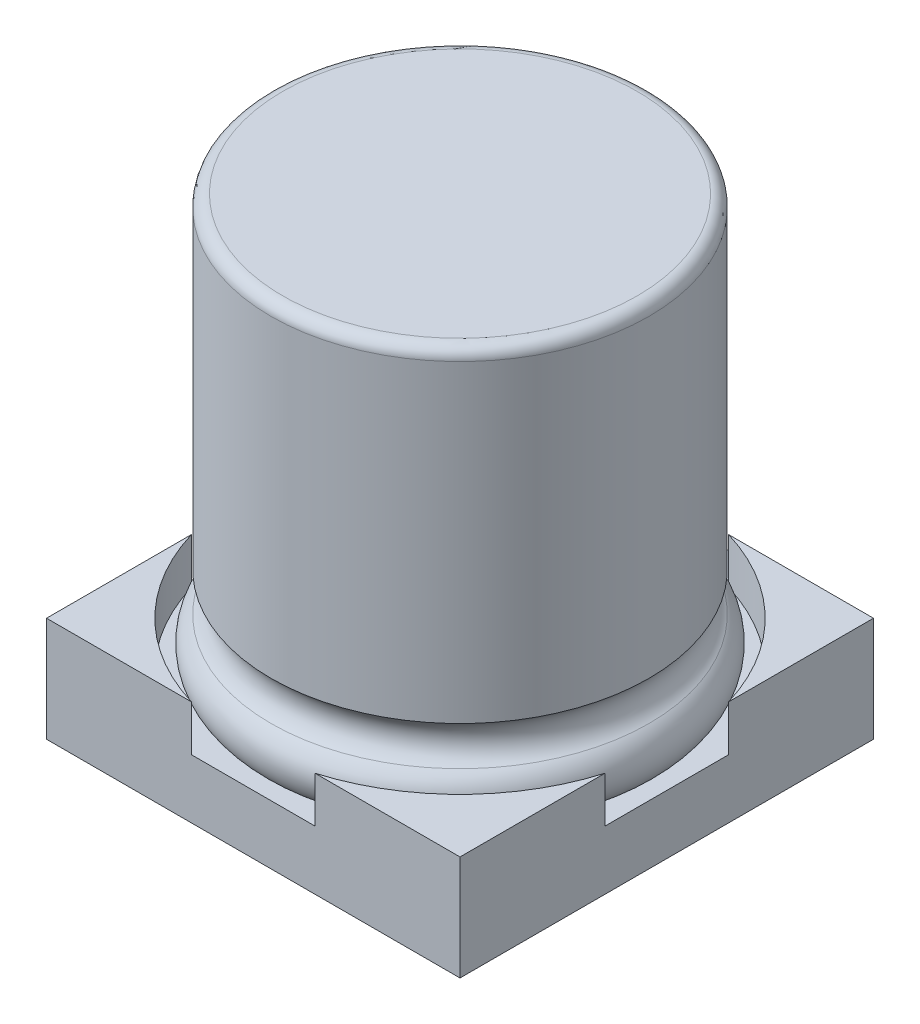
ISO-10303-21;
HEADER;
FILE_DESCRIPTION(('STEP AP214'),'2;1');
FILE_NAME('part.step','',(''),(''),'','','');
FILE_SCHEMA(('AUTOMOTIVE_DESIGN { 1 0 10303 214 1 1 1 1 }'));
ENDSEC;
DATA;
#1=APPLICATION_CONTEXT('core data for automotive mechanical design processes');
#2=APPLICATION_PROTOCOL_DEFINITION('international standard','automotive_design',2000,#1);
#3=PRODUCT_CONTEXT('',#1,'mechanical');
#4=PRODUCT('Part','Part','',(#3));
#5=PRODUCT_RELATED_PRODUCT_CATEGORY('part','',(#4));
#6=PRODUCT_DEFINITION_FORMATION('','',#4);
#7=PRODUCT_DEFINITION_CONTEXT('part definition',#1,'design');
#8=PRODUCT_DEFINITION('design','',#6,#7);
#9=PRODUCT_DEFINITION_SHAPE('','',#8);
#10=(LENGTH_UNIT() NAMED_UNIT(*) SI_UNIT(.MILLI.,.METRE.));
#11=(NAMED_UNIT(*) PLANE_ANGLE_UNIT() SI_UNIT($,.RADIAN.));
#12=(NAMED_UNIT(*) SI_UNIT($,.STERADIAN.) SOLID_ANGLE_UNIT());
#13=UNCERTAINTY_MEASURE_WITH_UNIT(LENGTH_MEASURE(1.E-05),#10,'distance_accuracy_value','');
#14=(GEOMETRIC_REPRESENTATION_CONTEXT(3) GLOBAL_UNCERTAINTY_ASSIGNED_CONTEXT((#13)) GLOBAL_UNIT_ASSIGNED_CONTEXT((#10,
#11,#12)) REPRESENTATION_CONTEXT('',''));
#15=CARTESIAN_POINT('',(0.,0.,0.));
#16=DIRECTION('',(0.,0.,1.));
#17=DIRECTION('',(1.,0.,0.));
#18=AXIS2_PLACEMENT_3D('',#15,#16,#17);
#19=CARTESIAN_POINT('',(0.,0.2,-4.6380085368));
#20=DIRECTION('',(0.,0.,-1.));
#21=DIRECTION('',(-1.,0.,0.));
#22=AXIS2_PLACEMENT_3D('',#19,#20,#21);
#23=PLANE('',#22);
#24=DIRECTION('',(1.,0.,0.));
#25=VECTOR('',#24,1.);
#26=CARTESIAN_POINT('',(-0.6,0.4,-4.6380085368));
#27=LINE('',#26,#25);
#28=CARTESIAN_POINT('',(0.6,0.4,-4.6380085368));
#29=VERTEX_POINT('',#28);
#30=CARTESIAN_POINT('',(-0.6,0.4,-4.6380085368));
#31=VERTEX_POINT('',#30);
#32=EDGE_CURVE('E156',#29,#31,#27,.F.);
#33=ORIENTED_EDGE('',*,*,#32,.F.);
#34=DIRECTION('',(0.,1.,0.));
#35=VECTOR('',#34,1.);
#36=CARTESIAN_POINT('',(0.6,0.4,-4.6380085368));
#37=LINE('',#36,#35);
#38=CARTESIAN_POINT('',(0.6,0.,-4.6380085368));
#39=VERTEX_POINT('',#38);
#40=EDGE_CURVE('E164',#39,#29,#37,.T.);
#41=ORIENTED_EDGE('',*,*,#40,.F.);
#42=DIRECTION('',(1.,0.,0.));
#43=VECTOR('',#42,1.);
#44=CARTESIAN_POINT('',(0.,0.,-4.6380085368));
#45=LINE('',#44,#43);
#46=CARTESIAN_POINT('',(-0.6,0.,-4.6380085368));
#47=VERTEX_POINT('',#46);
#48=EDGE_CURVE('E159',#39,#47,#45,.F.);
#49=ORIENTED_EDGE('',*,*,#48,.T.);
#50=DIRECTION('',(0.,1.,0.));
#51=VECTOR('',#50,1.);
#52=CARTESIAN_POINT('',(-0.6,0.,-4.6380085368));
#53=LINE('',#52,#51);
#54=EDGE_CURVE('E153',#31,#47,#53,.F.);
#55=ORIENTED_EDGE('',*,*,#54,.F.);
#56=EDGE_LOOP('',(#33,#41,#49,#55));
#57=FACE_BOUND('',#56,.T.);
#58=ADVANCED_FACE('F16',(#57),#23,.T.);
#59=CARTESIAN_POINT('',(-0.6,0.,-3.5));
#60=DIRECTION('',(-1.,0.,0.));
#61=DIRECTION('',(0.,0.,1.));
#62=AXIS2_PLACEMENT_3D('',#59,#60,#61);
#63=PLANE('',#62);
#64=ORIENTED_EDGE('',*,*,#54,.T.);
#65=DIRECTION('',(0.,0.,1.));
#66=VECTOR('',#65,1.);
#67=CARTESIAN_POINT('',(-0.6,0.,0.));
#68=LINE('',#67,#66);
#69=CARTESIAN_POINT('',(-0.6,0.,-3.5));
#70=VERTEX_POINT('',#69);
#71=EDGE_CURVE('E257',#47,#70,#68,.T.);
#72=ORIENTED_EDGE('',*,*,#71,.T.);
#73=DIRECTION('',(0.,1.,0.));
#74=VECTOR('',#73,1.);
#75=CARTESIAN_POINT('',(-0.6,0.,-3.5));
#76=LINE('',#75,#74);
#77=CARTESIAN_POINT('',(-0.6,0.4,-3.5));
#78=VERTEX_POINT('',#77);
#79=EDGE_CURVE('E170',#78,#70,#76,.F.);
#80=ORIENTED_EDGE('',*,*,#79,.F.);
#81=DIRECTION('',(0.,0.,1.));
#82=VECTOR('',#81,1.);
#83=CARTESIAN_POINT('',(-0.6,0.4,-3.5));
#84=LINE('',#83,#82);
#85=EDGE_CURVE('E167',#31,#78,#84,.T.);
#86=ORIENTED_EDGE('',*,*,#85,.F.);
#87=EDGE_LOOP('',(#64,#72,#80,#86));
#88=FACE_BOUND('',#87,.T.);
#89=ADVANCED_FACE('F168',(#88),#63,.T.);
#90=CARTESIAN_POINT('',(0.6,0.4,-3.5));
#91=DIRECTION('',(1.,0.,0.));
#92=DIRECTION('',(0.,0.,-1.));
#93=AXIS2_PLACEMENT_3D('',#90,#91,#92);
#94=PLANE('',#93);
#95=ORIENTED_EDGE('',*,*,#40,.T.);
#96=DIRECTION('',(0.,0.,1.));
#97=VECTOR('',#96,1.);
#98=CARTESIAN_POINT('',(0.6,0.4,-3.5));
#99=LINE('',#98,#97);
#100=CARTESIAN_POINT('',(0.6,0.4,-3.5));
#101=VERTEX_POINT('',#100);
#102=EDGE_CURVE('E178',#101,#29,#99,.F.);
#103=ORIENTED_EDGE('',*,*,#102,.F.);
#104=DIRECTION('',(0.,1.,0.));
#105=VECTOR('',#104,1.);
#106=CARTESIAN_POINT('',(0.6,0.,-3.5));
#107=LINE('',#106,#105);
#108=CARTESIAN_POINT('',(0.6,0.,-3.5));
#109=VERTEX_POINT('',#108);
#110=EDGE_CURVE('E239',#109,#101,#107,.T.);
#111=ORIENTED_EDGE('',*,*,#110,.F.);
#112=DIRECTION('',(0.,0.,1.));
#113=VECTOR('',#112,1.);
#114=CARTESIAN_POINT('',(0.6,0.,0.));
#115=LINE('',#114,#113);
#116=EDGE_CURVE('E258',#109,#39,#115,.F.);
#117=ORIENTED_EDGE('',*,*,#116,.T.);
#118=EDGE_LOOP('',(#95,#103,#111,#117));
#119=FACE_BOUND('',#118,.T.);
#120=ADVANCED_FACE('F265',(#119),#94,.T.);
#121=CARTESIAN_POINT('',(-0.6,0.4,-3.5));
#122=DIRECTION('',(0.,1.,0.));
#123=DIRECTION('',(0.,0.,1.));
#124=AXIS2_PLACEMENT_3D('',#121,#122,#123);
#125=PLANE('',#124);
#126=ORIENTED_EDGE('',*,*,#32,.T.);
#127=ORIENTED_EDGE('',*,*,#85,.T.);
#128=DIRECTION('',(-1.,0.,0.));
#129=VECTOR('',#128,1.);
#130=CARTESIAN_POINT('',(3.5,0.4,-3.5));
#131=LINE('',#130,#129);
#132=EDGE_CURVE('E230',#101,#78,#131,.T.);
#133=ORIENTED_EDGE('',*,*,#132,.F.);
#134=ORIENTED_EDGE('',*,*,#102,.T.);
#135=EDGE_LOOP('',(#126,#127,#133,#134));
#136=FACE_BOUND('',#135,.T.);
#137=ADVANCED_FACE('F177',(#136),#125,.T.);
#138=CARTESIAN_POINT('',(-2.27357437807846,1.775,-2.27357437807846));
#139=DIRECTION('',(0.,1.,0.));
#140=DIRECTION('',(0.,0.,1.));
#141=AXIS2_PLACEMENT_3D('',#138,#139,#140);
#142=PLANE('',#141);
#143=DIRECTION('',(0.,0.,1.));
#144=VECTOR('',#143,1.);
#145=CARTESIAN_POINT('',(-3.5,1.775,-2.27357437807846));
#146=LINE('',#145,#144);
#147=CARTESIAN_POINT('',(-3.5,1.775,-2.268));
#148=VERTEX_POINT('',#147);
#149=CARTESIAN_POINT('',(-3.5,1.775,-1.04714875615693));
#150=VERTEX_POINT('',#149);
#151=EDGE_CURVE('E175',#148,#150,#146,.T.);
#152=ORIENTED_EDGE('',*,*,#151,.T.);
#153=CARTESIAN_POINT('',(0.,1.775,0.));
#154=DIRECTION('',(0.,1.,0.));
#155=DIRECTION('',(0.,0.,1.));
#156=AXIS2_PLACEMENT_3D('',#153,#154,#155);
#157=CIRCLE('',#156,3.653289);
#158=CARTESIAN_POINT('',(-1.04714875615693,1.775,-3.5));
#159=VERTEX_POINT('',#158);
#160=EDGE_CURVE('E227',#150,#159,#157,.F.);
#161=ORIENTED_EDGE('',*,*,#160,.T.);
#162=DIRECTION('',(-1.,0.,0.));
#163=VECTOR('',#162,1.);
#164=CARTESIAN_POINT('',(3.5,1.775,-3.5));
#165=LINE('',#164,#163);
#166=CARTESIAN_POINT('',(-2.268,1.775,-3.5));
#167=VERTEX_POINT('',#166);
#168=EDGE_CURVE('E383',#167,#159,#165,.F.);
#169=ORIENTED_EDGE('',*,*,#168,.F.);
#170=DIRECTION('',(-0.707106781186547,0.,0.707106781186548));
#171=VECTOR('',#170,1.);
#172=CARTESIAN_POINT('',(-2.884,1.775,-2.884));
#173=LINE('',#172,#171);
#174=EDGE_CURVE('E119',#148,#167,#173,.F.);
#175=ORIENTED_EDGE('',*,*,#174,.F.);
#176=EDGE_LOOP('',(#152,#161,#169,#175));
#177=FACE_BOUND('',#176,.T.);
#178=ADVANCED_FACE('F413',(#177),#142,.T.);
#179=CARTESIAN_POINT('',(-2.884,0.,-2.884));
#180=DIRECTION('',(-0.707106781186548,0.,-0.707106781186547));
#181=DIRECTION('',(-0.707106781186547,0.,0.707106781186548));
#182=AXIS2_PLACEMENT_3D('',#179,#180,#181);
#183=PLANE('',#182);
#184=DIRECTION('',(0.,1.,0.));
#185=VECTOR('',#184,1.);
#186=CARTESIAN_POINT('',(-3.5,0.,-2.268));
#187=LINE('',#186,#185);
#188=CARTESIAN_POINT('',(-3.5,0.,-2.268));
#189=VERTEX_POINT('',#188);
#190=EDGE_CURVE('E236',#148,#189,#187,.F.);
#191=ORIENTED_EDGE('',*,*,#190,.F.);
#192=ORIENTED_EDGE('',*,*,#174,.T.);
#193=DIRECTION('',(0.,1.,0.));
#194=VECTOR('',#193,1.);
#195=CARTESIAN_POINT('',(-2.268,0.,-3.5));
#196=LINE('',#195,#194);
#197=CARTESIAN_POINT('',(-2.268,0.,-3.5));
#198=VERTEX_POINT('',#197);
#199=EDGE_CURVE('E292',#198,#167,#196,.T.);
#200=ORIENTED_EDGE('',*,*,#199,.F.);
#201=DIRECTION('',(-0.707106781186548,0.,0.707106781186548));
#202=VECTOR('',#201,1.);
#203=CARTESIAN_POINT('',(-2.268,0.,-3.5));
#204=LINE('',#203,#202);
#205=EDGE_CURVE('E277',#198,#189,#204,.T.);
#206=ORIENTED_EDGE('',*,*,#205,.T.);
#207=EDGE_LOOP('',(#191,#192,#200,#206));
#208=FACE_BOUND('',#207,.T.);
#209=ADVANCED_FACE('F402',(#208),#183,.T.);
#210=CARTESIAN_POINT('',(-2.27357437807847,1.775,2.27357437807846));
#211=DIRECTION('',(0.,1.,0.));
#212=DIRECTION('',(0.,0.,1.));
#213=AXIS2_PLACEMENT_3D('',#210,#211,#212);
#214=PLANE('',#213);
#215=DIRECTION('',(1.,0.,0.));
#216=VECTOR('',#215,1.);
#217=CARTESIAN_POINT('',(-3.5,1.775,3.5));
#218=LINE('',#217,#216);
#219=CARTESIAN_POINT('',(-1.04714875615693,1.775,3.5));
#220=VERTEX_POINT('',#219);
#221=CARTESIAN_POINT('',(-3.5,1.775,3.5));
#222=VERTEX_POINT('',#221);
#223=EDGE_CURVE('E348',#220,#222,#218,.F.);
#224=ORIENTED_EDGE('',*,*,#223,.F.);
#225=CARTESIAN_POINT('',(0.,1.775,0.));
#226=DIRECTION('',(0.,1.,0.));
#227=DIRECTION('',(0.,0.,1.));
#228=AXIS2_PLACEMENT_3D('',#225,#226,#227);
#229=CIRCLE('',#228,3.653289);
#230=CARTESIAN_POINT('',(-3.5,1.775,1.04714875615693));
#231=VERTEX_POINT('',#230);
#232=EDGE_CURVE('E223',#220,#231,#229,.F.);
#233=ORIENTED_EDGE('',*,*,#232,.T.);
#234=DIRECTION('',(0.,0.,1.));
#235=VECTOR('',#234,1.);
#236=CARTESIAN_POINT('',(-3.5,1.775,-3.5));
#237=LINE('',#236,#235);
#238=EDGE_CURVE('E360',#222,#231,#237,.F.);
#239=ORIENTED_EDGE('',*,*,#238,.F.);
#240=EDGE_LOOP('',(#224,#233,#239));
#241=FACE_BOUND('',#240,.T.);
#242=ADVANCED_FACE('F421',(#241),#214,.T.);
#243=CARTESIAN_POINT('',(0.,0.,0.));
#244=DIRECTION('',(0.,1.,0.));
#245=DIRECTION('',(0.,0.,1.));
#246=AXIS2_PLACEMENT_3D('',#243,#244,#245);
#247=PLANE('',#246);
#248=DIRECTION('',(-1.,0.,0.));
#249=VECTOR('',#248,1.);
#250=CARTESIAN_POINT('',(3.5,0.,-3.5));
#251=LINE('',#250,#249);
#252=EDGE_CURVE('E275',#70,#198,#251,.T.);
#253=ORIENTED_EDGE('',*,*,#252,.F.);
#254=ORIENTED_EDGE('',*,*,#71,.F.);
#255=ORIENTED_EDGE('',*,*,#48,.F.);
#256=ORIENTED_EDGE('',*,*,#116,.F.);
#257=DIRECTION('',(-1.,0.,0.));
#258=VECTOR('',#257,1.);
#259=CARTESIAN_POINT('',(3.5,0.,-3.5));
#260=LINE('',#259,#258);
#261=CARTESIAN_POINT('',(3.5,0.,-3.5));
#262=VERTEX_POINT('',#261);
#263=EDGE_CURVE('E246',#262,#109,#260,.T.);
#264=ORIENTED_EDGE('',*,*,#263,.F.);
#265=DIRECTION('',(0.,0.,-1.));
#266=VECTOR('',#265,1.);
#267=CARTESIAN_POINT('',(3.5,0.,3.5));
#268=LINE('',#267,#266);
#269=CARTESIAN_POINT('',(3.5,0.,3.5));
#270=VERTEX_POINT('',#269);
#271=EDGE_CURVE('E319',#270,#262,#268,.T.);
#272=ORIENTED_EDGE('',*,*,#271,.F.);
#273=DIRECTION('',(1.,0.,0.));
#274=VECTOR('',#273,1.);
#275=CARTESIAN_POINT('',(-3.5,0.,3.5));
#276=LINE('',#275,#274);
#277=CARTESIAN_POINT('',(-3.5,0.,3.5));
#278=VERTEX_POINT('',#277);
#279=EDGE_CURVE('E342',#278,#270,#276,.T.);
#280=ORIENTED_EDGE('',*,*,#279,.F.);
#281=DIRECTION('',(0.,0.,1.));
#282=VECTOR('',#281,1.);
#283=CARTESIAN_POINT('',(-3.5,0.,-3.5));
#284=LINE('',#283,#282);
#285=EDGE_CURVE('E364',#189,#278,#284,.T.);
#286=ORIENTED_EDGE('',*,*,#285,.F.);
#287=ORIENTED_EDGE('',*,*,#205,.F.);
#288=EDGE_LOOP('',(#253,#254,#255,#256,#264,#272,#280,#286,#287));
#289=FACE_BOUND('',#288,.T.);
#290=ADVANCED_FACE('F273',(#289),#247,.F.);
#291=CARTESIAN_POINT('',(2.27357437807847,1.775,-2.27357437807847));
#292=DIRECTION('',(0.,1.,0.));
#293=DIRECTION('',(0.,0.,1.));
#294=AXIS2_PLACEMENT_3D('',#291,#292,#293);
#295=PLANE('',#294);
#296=DIRECTION('',(-1.,0.,0.));
#297=VECTOR('',#296,1.);
#298=CARTESIAN_POINT('',(3.5,1.775,-3.5));
#299=LINE('',#298,#297);
#300=CARTESIAN_POINT('',(1.04714875615693,1.775,-3.5));
#301=VERTEX_POINT('',#300);
#302=CARTESIAN_POINT('',(3.5,1.775,-3.5));
#303=VERTEX_POINT('',#302);
#304=EDGE_CURVE('E304',#301,#303,#299,.F.);
#305=ORIENTED_EDGE('',*,*,#304,.F.);
#306=CARTESIAN_POINT('',(0.,1.775,0.));
#307=DIRECTION('',(0.,1.,0.));
#308=DIRECTION('',(0.,0.,1.));
#309=AXIS2_PLACEMENT_3D('',#306,#307,#308);
#310=CIRCLE('',#309,3.653289);
#311=CARTESIAN_POINT('',(3.5,1.775,-1.04714875615693));
#312=VERTEX_POINT('',#311);
#313=EDGE_CURVE('E19',#301,#312,#310,.F.);
#314=ORIENTED_EDGE('',*,*,#313,.T.);
#315=DIRECTION('',(0.,0.,-1.));
#316=VECTOR('',#315,1.);
#317=CARTESIAN_POINT('',(3.5,1.775,3.5));
#318=LINE('',#317,#316);
#319=EDGE_CURVE('E301',#303,#312,#318,.F.);
#320=ORIENTED_EDGE('',*,*,#319,.F.);
#321=EDGE_LOOP('',(#305,#314,#320));
#322=FACE_BOUND('',#321,.T.);
#323=ADVANCED_FACE('F298',(#322),#295,.T.);
#324=CARTESIAN_POINT('',(2.27357437807847,1.775,2.27357437807847));
#325=DIRECTION('',(0.,1.,0.));
#326=DIRECTION('',(0.,0.,1.));
#327=AXIS2_PLACEMENT_3D('',#324,#325,#326);
#328=PLANE('',#327);
#329=DIRECTION('',(0.,0.,-1.));
#330=VECTOR('',#329,1.);
#331=CARTESIAN_POINT('',(3.5,1.775,3.5));
#332=LINE('',#331,#330);
#333=CARTESIAN_POINT('',(3.5,1.775,1.04714875615693));
#334=VERTEX_POINT('',#333);
#335=CARTESIAN_POINT('',(3.5,1.775,3.5));
#336=VERTEX_POINT('',#335);
#337=EDGE_CURVE('E498',#334,#336,#332,.F.);
#338=ORIENTED_EDGE('',*,*,#337,.F.);
#339=CARTESIAN_POINT('',(0.,1.775,0.));
#340=DIRECTION('',(0.,1.,0.));
#341=DIRECTION('',(0.,0.,1.));
#342=AXIS2_PLACEMENT_3D('',#339,#340,#341);
#343=CIRCLE('',#342,3.653289);
#344=CARTESIAN_POINT('',(1.04714875615693,1.775,3.5));
#345=VERTEX_POINT('',#344);
#346=EDGE_CURVE('E218',#334,#345,#343,.F.);
#347=ORIENTED_EDGE('',*,*,#346,.T.);
#348=DIRECTION('',(1.,0.,0.));
#349=VECTOR('',#348,1.);
#350=CARTESIAN_POINT('',(-3.5,1.775,3.5));
#351=LINE('',#350,#349);
#352=EDGE_CURVE('E345',#336,#345,#351,.F.);
#353=ORIENTED_EDGE('',*,*,#352,.F.);
#354=EDGE_LOOP('',(#338,#347,#353));
#355=FACE_BOUND('',#354,.T.);
#356=ADVANCED_FACE('F553',(#355),#328,.T.);
#357=CARTESIAN_POINT('',(0.,1.,0.));
#358=DIRECTION('',(0.,1.,0.));
#359=DIRECTION('',(0.,0.,1.));
#360=AXIS2_PLACEMENT_3D('',#357,#358,#359);
#361=CYLINDRICAL_SURFACE('',#360,3.653289);
#362=DIRECTION('',(0.,1.,0.));
#363=VECTOR('',#362,1.);
#364=CARTESIAN_POINT('',(3.5,0.,-1.04714875615693));
#365=LINE('',#364,#363);
#366=CARTESIAN_POINT('',(3.5,1.,-1.04714875615693));
#367=VERTEX_POINT('',#366);
#368=EDGE_CURVE('E307',#312,#367,#365,.F.);
#369=ORIENTED_EDGE('',*,*,#368,.F.);
#370=ORIENTED_EDGE('',*,*,#313,.F.);
#371=DIRECTION('',(0.,1.,0.));
#372=VECTOR('',#371,1.);
#373=CARTESIAN_POINT('',(1.04714875615693,0.,-3.5));
#374=LINE('',#373,#372);
#375=CARTESIAN_POINT('',(1.04714875615693,1.,-3.5));
#376=VERTEX_POINT('',#375);
#377=EDGE_CURVE('E331',#376,#301,#374,.T.);
#378=ORIENTED_EDGE('',*,*,#377,.F.);
#379=CARTESIAN_POINT('',(0.,1.,0.));
#380=DIRECTION('',(0.,1.,0.));
#381=DIRECTION('',(0.,0.,1.));
#382=AXIS2_PLACEMENT_3D('',#379,#380,#381);
#383=CIRCLE('',#382,3.653289);
#384=EDGE_CURVE('E213',#367,#376,#383,.T.);
#385=ORIENTED_EDGE('',*,*,#384,.F.);
#386=EDGE_LOOP('',(#369,#370,#378,#385));
#387=FACE_BOUND('',#386,.T.);
#388=ADVANCED_FACE('F308',(#387),#361,.F.);
#389=CARTESIAN_POINT('',(3.5,0.,-3.5));
#390=DIRECTION('',(0.,0.,-1.));
#391=DIRECTION('',(-1.,0.,0.));
#392=AXIS2_PLACEMENT_3D('',#389,#390,#391);
#393=PLANE('',#392);
#394=ORIENTED_EDGE('',*,*,#110,.T.);
#395=ORIENTED_EDGE('',*,*,#132,.T.);
#396=ORIENTED_EDGE('',*,*,#79,.T.);
#397=ORIENTED_EDGE('',*,*,#252,.T.);
#398=ORIENTED_EDGE('',*,*,#199,.T.);
#399=ORIENTED_EDGE('',*,*,#168,.T.);
#400=DIRECTION('',(0.,1.,0.));
#401=VECTOR('',#400,1.);
#402=CARTESIAN_POINT('',(-1.04714875615693,1.,-3.5));
#403=LINE('',#402,#401);
#404=CARTESIAN_POINT('',(-1.04714875615693,1.,-3.5));
#405=VERTEX_POINT('',#404);
#406=EDGE_CURVE('E229',#159,#405,#403,.F.);
#407=ORIENTED_EDGE('',*,*,#406,.T.);
#408=DIRECTION('',(1.,0.,0.));
#409=VECTOR('',#408,1.);
#410=CARTESIAN_POINT('',(0.,1.,-3.5));
#411=LINE('',#410,#409);
#412=EDGE_CURVE('E212',#376,#405,#411,.F.);
#413=ORIENTED_EDGE('',*,*,#412,.F.);
#414=ORIENTED_EDGE('',*,*,#377,.T.);
#415=ORIENTED_EDGE('',*,*,#304,.T.);
#416=DIRECTION('',(0.,1.,0.));
#417=VECTOR('',#416,1.);
#418=CARTESIAN_POINT('',(3.5,0.,-3.5));
#419=LINE('',#418,#417);
#420=EDGE_CURVE('E317',#262,#303,#419,.T.);
#421=ORIENTED_EDGE('',*,*,#420,.F.);
#422=ORIENTED_EDGE('',*,*,#263,.T.);
#423=EDGE_LOOP('',(#394,#395,#396,#397,#398,#399,#407,#413,#414,#415,#421,#422));
#424=FACE_BOUND('',#423,.T.);
#425=ADVANCED_FACE('F400',(#424),#393,.T.);
#426=CARTESIAN_POINT('',(0.,1.,0.));
#427=DIRECTION('',(0.,1.,0.));
#428=DIRECTION('',(0.,0.,1.));
#429=AXIS2_PLACEMENT_3D('',#426,#427,#428);
#430=CYLINDRICAL_SURFACE('',#429,3.653289);
#431=ORIENTED_EDGE('',*,*,#406,.F.);
#432=ORIENTED_EDGE('',*,*,#160,.F.);
#433=DIRECTION('',(0.,1.,0.));
#434=VECTOR('',#433,1.);
#435=CARTESIAN_POINT('',(-3.5,0.,-1.04714875615693));
#436=LINE('',#435,#434);
#437=CARTESIAN_POINT('',(-3.5,1.,-1.04714875615693));
#438=VERTEX_POINT('',#437);
#439=EDGE_CURVE('E226',#438,#150,#436,.T.);
#440=ORIENTED_EDGE('',*,*,#439,.F.);
#441=CARTESIAN_POINT('',(0.,1.,0.));
#442=DIRECTION('',(0.,1.,0.));
#443=DIRECTION('',(0.,0.,1.));
#444=AXIS2_PLACEMENT_3D('',#441,#442,#443);
#445=CIRCLE('',#444,3.653289);
#446=EDGE_CURVE('E208',#405,#438,#445,.T.);
#447=ORIENTED_EDGE('',*,*,#446,.F.);
#448=EDGE_LOOP('',(#431,#432,#440,#447));
#449=FACE_BOUND('',#448,.T.);
#450=ADVANCED_FACE('F607',(#449),#430,.F.);
#451=CARTESIAN_POINT('',(-3.5,0.,-3.5));
#452=DIRECTION('',(-1.,0.,0.));
#453=DIRECTION('',(0.,0.,1.));
#454=AXIS2_PLACEMENT_3D('',#451,#452,#453);
#455=PLANE('',#454);
#456=ORIENTED_EDGE('',*,*,#439,.T.);
#457=ORIENTED_EDGE('',*,*,#151,.F.);
#458=ORIENTED_EDGE('',*,*,#190,.T.);
#459=ORIENTED_EDGE('',*,*,#285,.T.);
#460=DIRECTION('',(0.,1.,0.));
#461=VECTOR('',#460,1.);
#462=CARTESIAN_POINT('',(-3.5,0.,3.5));
#463=LINE('',#462,#461);
#464=EDGE_CURVE('E222',#222,#278,#463,.F.);
#465=ORIENTED_EDGE('',*,*,#464,.F.);
#466=ORIENTED_EDGE('',*,*,#238,.T.);
#467=DIRECTION('',(0.,1.,0.));
#468=VECTOR('',#467,1.);
#469=CARTESIAN_POINT('',(-3.5,1.,1.04714875615693));
#470=LINE('',#469,#468);
#471=CARTESIAN_POINT('',(-3.5,1.,1.04714875615693));
#472=VERTEX_POINT('',#471);
#473=EDGE_CURVE('E225',#231,#472,#470,.F.);
#474=ORIENTED_EDGE('',*,*,#473,.T.);
#475=DIRECTION('',(0.,0.,1.));
#476=VECTOR('',#475,1.);
#477=CARTESIAN_POINT('',(-3.5,1.,0.));
#478=LINE('',#477,#476);
#479=EDGE_CURVE('E207',#438,#472,#478,.T.);
#480=ORIENTED_EDGE('',*,*,#479,.F.);
#481=EDGE_LOOP('',(#456,#457,#458,#459,#465,#466,#474,#480));
#482=FACE_BOUND('',#481,.T.);
#483=ADVANCED_FACE('F411',(#482),#455,.T.);
#484=CARTESIAN_POINT('',(0.,1.,0.));
#485=DIRECTION('',(0.,1.,0.));
#486=DIRECTION('',(0.,0.,1.));
#487=AXIS2_PLACEMENT_3D('',#484,#485,#486);
#488=CYLINDRICAL_SURFACE('',#487,3.653289);
#489=ORIENTED_EDGE('',*,*,#473,.F.);
#490=ORIENTED_EDGE('',*,*,#232,.F.);
#491=DIRECTION('',(0.,1.,0.));
#492=VECTOR('',#491,1.);
#493=CARTESIAN_POINT('',(-1.04714875615693,0.,3.5));
#494=LINE('',#493,#492);
#495=CARTESIAN_POINT('',(-1.04714875615693,1.,3.5));
#496=VERTEX_POINT('',#495);
#497=EDGE_CURVE('E352',#496,#220,#494,.T.);
#498=ORIENTED_EDGE('',*,*,#497,.F.);
#499=CARTESIAN_POINT('',(0.,1.,0.));
#500=DIRECTION('',(0.,1.,0.));
#501=DIRECTION('',(0.,0.,1.));
#502=AXIS2_PLACEMENT_3D('',#499,#500,#501);
#503=CIRCLE('',#502,3.653289);
#504=EDGE_CURVE('E204',#472,#496,#503,.T.);
#505=ORIENTED_EDGE('',*,*,#504,.F.);
#506=EDGE_LOOP('',(#489,#490,#498,#505));
#507=FACE_BOUND('',#506,.T.);
#508=ADVANCED_FACE('F533',(#507),#488,.F.);
#509=CARTESIAN_POINT('',(-3.5,0.,3.5));
#510=DIRECTION('',(0.,0.,1.));
#511=DIRECTION('',(1.,0.,0.));
#512=AXIS2_PLACEMENT_3D('',#509,#510,#511);
#513=PLANE('',#512);
#514=ORIENTED_EDGE('',*,*,#223,.T.);
#515=ORIENTED_EDGE('',*,*,#464,.T.);
#516=ORIENTED_EDGE('',*,*,#279,.T.);
#517=DIRECTION('',(0.,1.,0.));
#518=VECTOR('',#517,1.);
#519=CARTESIAN_POINT('',(3.5,0.,3.5));
#520=LINE('',#519,#518);
#521=EDGE_CURVE('E217',#336,#270,#520,.F.);
#522=ORIENTED_EDGE('',*,*,#521,.F.);
#523=ORIENTED_EDGE('',*,*,#352,.T.);
#524=DIRECTION('',(0.,1.,0.));
#525=VECTOR('',#524,1.);
#526=CARTESIAN_POINT('',(1.04714875615693,1.,3.5));
#527=LINE('',#526,#525);
#528=CARTESIAN_POINT('',(1.04714875615693,1.,3.5));
#529=VERTEX_POINT('',#528);
#530=EDGE_CURVE('E221',#345,#529,#527,.F.);
#531=ORIENTED_EDGE('',*,*,#530,.T.);
#532=DIRECTION('',(1.,0.,0.));
#533=VECTOR('',#532,1.);
#534=CARTESIAN_POINT('',(0.,1.,3.5));
#535=LINE('',#534,#533);
#536=EDGE_CURVE('E203',#496,#529,#535,.T.);
#537=ORIENTED_EDGE('',*,*,#536,.F.);
#538=ORIENTED_EDGE('',*,*,#497,.T.);
#539=EDGE_LOOP('',(#514,#515,#516,#522,#523,#531,#537,#538));
#540=FACE_BOUND('',#539,.T.);
#541=ADVANCED_FACE('F523',(#540),#513,.T.);
#542=CARTESIAN_POINT('',(0.,1.,0.));
#543=DIRECTION('',(0.,1.,0.));
#544=DIRECTION('',(0.,0.,1.));
#545=AXIS2_PLACEMENT_3D('',#542,#543,#544);
#546=CYLINDRICAL_SURFACE('',#545,3.653289);
#547=ORIENTED_EDGE('',*,*,#530,.F.);
#548=ORIENTED_EDGE('',*,*,#346,.F.);
#549=DIRECTION('',(0.,1.,0.));
#550=VECTOR('',#549,1.);
#551=CARTESIAN_POINT('',(3.5,0.,1.04714875615693));
#552=LINE('',#551,#550);
#553=CARTESIAN_POINT('',(3.5,1.,1.04714875615693));
#554=VERTEX_POINT('',#553);
#555=EDGE_CURVE('E39',#554,#334,#552,.T.);
#556=ORIENTED_EDGE('',*,*,#555,.F.);
#557=CARTESIAN_POINT('',(0.,1.,0.));
#558=DIRECTION('',(0.,1.,0.));
#559=DIRECTION('',(0.,0.,1.));
#560=AXIS2_PLACEMENT_3D('',#557,#558,#559);
#561=CIRCLE('',#560,3.653289);
#562=EDGE_CURVE('E199',#529,#554,#561,.T.);
#563=ORIENTED_EDGE('',*,*,#562,.F.);
#564=EDGE_LOOP('',(#547,#548,#556,#563));
#565=FACE_BOUND('',#564,.T.);
#566=ADVANCED_FACE('F527',(#565),#546,.F.);
#567=CARTESIAN_POINT('',(3.5,0.,3.5));
#568=DIRECTION('',(1.,0.,0.));
#569=DIRECTION('',(0.,0.,-1.));
#570=AXIS2_PLACEMENT_3D('',#567,#568,#569);
#571=PLANE('',#570);
#572=ORIENTED_EDGE('',*,*,#337,.T.);
#573=ORIENTED_EDGE('',*,*,#521,.T.);
#574=ORIENTED_EDGE('',*,*,#271,.T.);
#575=ORIENTED_EDGE('',*,*,#420,.T.);
#576=ORIENTED_EDGE('',*,*,#319,.T.);
#577=ORIENTED_EDGE('',*,*,#368,.T.);
#578=DIRECTION('',(0.,0.,1.));
#579=VECTOR('',#578,1.);
#580=CARTESIAN_POINT('',(3.5,1.,0.));
#581=LINE('',#580,#579);
#582=EDGE_CURVE('E198',#554,#367,#581,.F.);
#583=ORIENTED_EDGE('',*,*,#582,.F.);
#584=ORIENTED_EDGE('',*,*,#555,.T.);
#585=EDGE_LOOP('',(#572,#573,#574,#575,#576,#577,#583,#584));
#586=FACE_BOUND('',#585,.T.);
#587=ADVANCED_FACE('F314',(#586),#571,.T.);
#588=CARTESIAN_POINT('',(0.,1.,0.));
#589=DIRECTION('',(0.,1.,0.));
#590=DIRECTION('',(0.,0.,1.));
#591=AXIS2_PLACEMENT_3D('',#588,#589,#590);
#592=PLANE('',#591);
#593=CARTESIAN_POINT('',(0.,1.,0.));
#594=DIRECTION('',(0.,-1.,0.));
#595=DIRECTION('',(1.,0.,0.));
#596=AXIS2_PLACEMENT_3D('',#593,#594,#595);
#597=CIRCLE('',#596,3.20000000000001);
#598=CARTESIAN_POINT('',(3.20000000000001,1.,0.));
#599=VERTEX_POINT('',#598);
#600=EDGE_CURVE('E193',#599,#599,#597,.F.);
#601=ORIENTED_EDGE('',*,*,#600,.F.);
#602=EDGE_LOOP('',(#601));
#603=FACE_BOUND('',#602,.T.);
#604=ORIENTED_EDGE('',*,*,#562,.T.);
#605=ORIENTED_EDGE('',*,*,#582,.T.);
#606=ORIENTED_EDGE('',*,*,#384,.T.);
#607=ORIENTED_EDGE('',*,*,#412,.T.);
#608=ORIENTED_EDGE('',*,*,#446,.T.);
#609=ORIENTED_EDGE('',*,*,#479,.T.);
#610=ORIENTED_EDGE('',*,*,#504,.T.);
#611=ORIENTED_EDGE('',*,*,#536,.T.);
#612=EDGE_LOOP('',(#604,#605,#606,#607,#608,#609,#610,#611));
#613=FACE_BOUND('',#612,.T.);
#614=ADVANCED_FACE('F466',(#603,#613),#592,.T.);
#615=CARTESIAN_POINT('',(3.,8.,0.));
#616=DIRECTION('',(0.,1.,0.));
#617=DIRECTION('',(-1.,0.,0.));
#618=AXIS2_PLACEMENT_3D('',#615,#616,#617);
#619=PLANE('',#618);
#620=CARTESIAN_POINT('',(0.,8.,0.));
#621=DIRECTION('',(0.,-1.,0.));
#622=DIRECTION('',(1.,0.,0.));
#623=AXIS2_PLACEMENT_3D('',#620,#621,#622);
#624=CIRCLE('',#623,3.);
#625=CARTESIAN_POINT('',(3.,8.,0.));
#626=VERTEX_POINT('',#625);
#627=EDGE_CURVE('E197',#626,#626,#624,.T.);
#628=ORIENTED_EDGE('',*,*,#627,.F.);
#629=EDGE_LOOP('',(#628));
#630=FACE_BOUND('',#629,.T.);
#631=ADVANCED_FACE('F461',(#630),#619,.T.);
#632=CARTESIAN_POINT('',(0.,1.41556817695327,0.));
#633=DIRECTION('',(0.,-1.,0.));
#634=DIRECTION('',(0.,0.,-1.));
#635=AXIS2_PLACEMENT_3D('',#632,#633,#634);
#636=TOROIDAL_SURFACE('',#635,2.87663642022782,0.526555708752026);
#637=ORIENTED_EDGE('',*,*,#600,.T.);
#638=EDGE_LOOP('',(#637));
#639=FACE_BOUND('',#638,.T.);
#640=CARTESIAN_POINT('',(0.,1.83113635390655,0.));
#641=DIRECTION('',(0.,-1.,0.));
#642=DIRECTION('',(0.,0.,-1.));
#643=AXIS2_PLACEMENT_3D('',#640,#641,#642);
#644=CIRCLE('',#643,3.2);
#645=CARTESIAN_POINT('',(0.,1.83113635390655,-3.2));
#646=VERTEX_POINT('',#645);
#647=EDGE_CURVE('E447',#646,#646,#644,.T.);
#648=ORIENTED_EDGE('',*,*,#647,.T.);
#649=EDGE_LOOP('',(#648));
#650=FACE_BOUND('',#649,.T.);
#651=ADVANCED_FACE('F458',(#639,#650),#636,.T.);
#652=CARTESIAN_POINT('',(0.,7.8,0.));
#653=DIRECTION('',(0.,-1.,0.));
#654=DIRECTION('',(0.,0.,-1.));
#655=AXIS2_PLACEMENT_3D('',#652,#653,#654);
#656=TOROIDAL_SURFACE('',#655,3.,0.2);
#657=CARTESIAN_POINT('',(0.,7.8,0.));
#658=DIRECTION('',(0.,-1.,0.));
#659=DIRECTION('',(1.,0.,0.));
#660=AXIS2_PLACEMENT_3D('',#657,#658,#659);
#661=CIRCLE('',#660,3.2);
#662=CARTESIAN_POINT('',(3.2,7.8,0.));
#663=VERTEX_POINT('',#662);
#664=EDGE_CURVE('E26',#663,#663,#661,.T.);
#665=ORIENTED_EDGE('',*,*,#664,.F.);
#666=EDGE_LOOP('',(#665));
#667=FACE_BOUND('',#666,.T.);
#668=ORIENTED_EDGE('',*,*,#627,.T.);
#669=EDGE_LOOP('',(#668));
#670=FACE_BOUND('',#669,.T.);
#671=ADVANCED_FACE('F433',(#667,#670),#656,.T.);
#672=CARTESIAN_POINT('',(0.,2.1620884566071,0.));
#673=DIRECTION('',(0.,-1.,0.));
#674=DIRECTION('',(0.,0.,-1.));
#675=AXIS2_PLACEMENT_3D('',#672,#673,#674);
#676=TOROIDAL_SURFACE('',#675,3.42497768365847,0.400180274909006);
#677=ORIENTED_EDGE('',*,*,#647,.F.);
#678=EDGE_LOOP('',(#677));
#679=FACE_BOUND('',#678,.T.);
#680=CARTESIAN_POINT('',(0.,2.49304055930765,0.));
#681=DIRECTION('',(0.,-1.,0.));
#682=DIRECTION('',(1.,0.,0.));
#683=AXIS2_PLACEMENT_3D('',#680,#681,#682);
#684=CIRCLE('',#683,3.2);
#685=CARTESIAN_POINT('',(3.2,2.49304055930765,0.));
#686=VERTEX_POINT('',#685);
#687=EDGE_CURVE('E11',#686,#686,#684,.F.);
#688=ORIENTED_EDGE('',*,*,#687,.F.);
#689=EDGE_LOOP('',(#688));
#690=FACE_BOUND('',#689,.T.);
#691=ADVANCED_FACE('F426',(#679,#690),#676,.F.);
#692=CARTESIAN_POINT('',(0.,5.14652027965383,0.));
#693=DIRECTION('',(0.,-1.,0.));
#694=DIRECTION('',(1.,0.,0.));
#695=AXIS2_PLACEMENT_3D('',#692,#693,#694);
#696=CYLINDRICAL_SURFACE('',#695,3.2);
#697=ORIENTED_EDGE('',*,*,#687,.T.);
#698=EDGE_LOOP('',(#697));
#699=FACE_BOUND('',#698,.T.);
#700=ORIENTED_EDGE('',*,*,#664,.T.);
#701=EDGE_LOOP('',(#700));
#702=FACE_BOUND('',#701,.T.);
#703=ADVANCED_FACE('F424',(#699,#702),#696,.T.);
#704=CLOSED_SHELL('',(#58,#89,#120,#137,#178,#209,#242,#290,#323,#356,#388,#425,#450,#483,#508,
#541,#566,#587,#614,#631,#651,#671,#691,#703));
#705=MANIFOLD_SOLID_BREP('B1',#704);
#706=ADVANCED_BREP_SHAPE_REPRESENTATION('',(#18,#705),#14);
#707=SHAPE_DEFINITION_REPRESENTATION(#9,#706);
ENDSEC;
END-ISO-10303-21;
